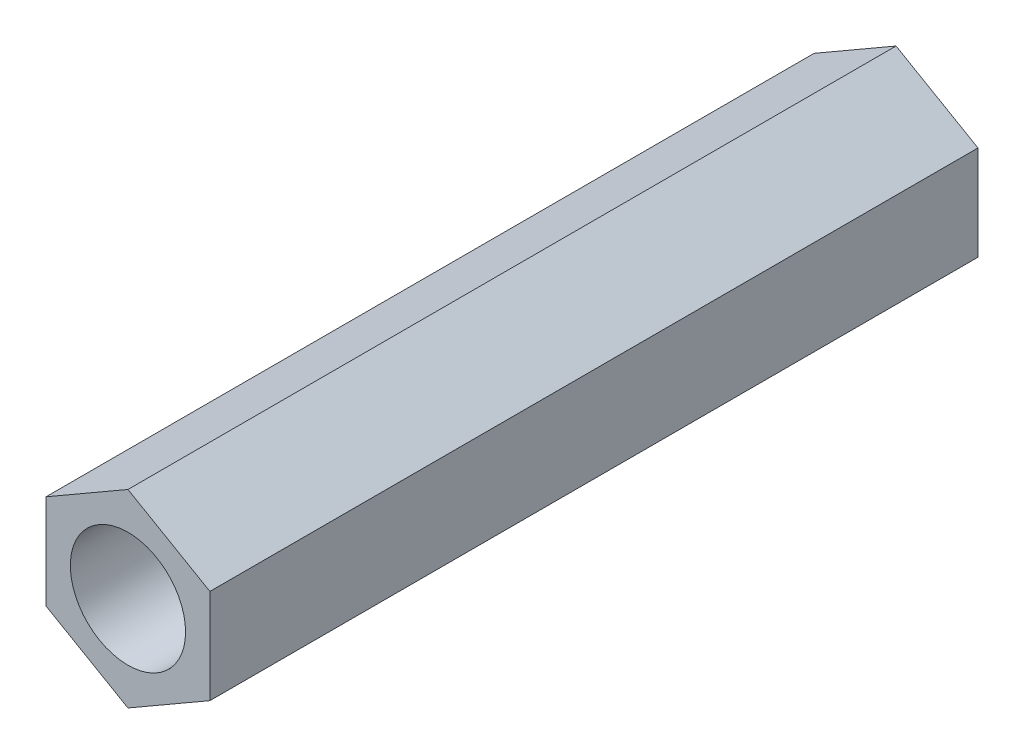
ISO-10303-21;
HEADER;
FILE_DESCRIPTION(('STEP AP214'),'2;1');
FILE_NAME('part.step','',(''),(''),'','','');
FILE_SCHEMA(('AUTOMOTIVE_DESIGN { 1 0 10303 214 1 1 1 1 }'));
ENDSEC;
DATA;
#1=APPLICATION_CONTEXT('core data for automotive mechanical design processes');
#2=APPLICATION_PROTOCOL_DEFINITION('international standard','automotive_design',2000,#1);
#3=PRODUCT_CONTEXT('',#1,'mechanical');
#4=PRODUCT('Part','Part','',(#3));
#5=PRODUCT_RELATED_PRODUCT_CATEGORY('part','',(#4));
#6=PRODUCT_DEFINITION_FORMATION('','',#4);
#7=PRODUCT_DEFINITION_CONTEXT('part definition',#1,'design');
#8=PRODUCT_DEFINITION('design','',#6,#7);
#9=PRODUCT_DEFINITION_SHAPE('','',#8);
#10=(LENGTH_UNIT() NAMED_UNIT(*) SI_UNIT(.MILLI.,.METRE.));
#11=(NAMED_UNIT(*) PLANE_ANGLE_UNIT() SI_UNIT($,.RADIAN.));
#12=(NAMED_UNIT(*) SI_UNIT($,.STERADIAN.) SOLID_ANGLE_UNIT());
#13=UNCERTAINTY_MEASURE_WITH_UNIT(LENGTH_MEASURE(1.E-05),#10,'distance_accuracy_value','');
#14=(GEOMETRIC_REPRESENTATION_CONTEXT(3) GLOBAL_UNCERTAINTY_ASSIGNED_CONTEXT((#13)) GLOBAL_UNIT_ASSIGNED_CONTEXT((#10,
#11,#12)) REPRESENTATION_CONTEXT('',''));
#15=CARTESIAN_POINT('',(0.,0.,0.));
#16=DIRECTION('',(0.,0.,1.));
#17=DIRECTION('',(1.,0.,0.));
#18=AXIS2_PLACEMENT_3D('',#15,#16,#17);
#19=CARTESIAN_POINT('',(0.,0.,20.));
#20=DIRECTION('',(0.,0.,1.));
#21=DIRECTION('',(1.,0.,0.));
#22=AXIS2_PLACEMENT_3D('',#19,#20,#21);
#23=PLANE('',#22);
#24=DIRECTION('',(-0.866025403784442,0.499999999999995,0.));
#25=VECTOR('',#24,1.);
#26=CARTESIAN_POINT('',(2.13382530169226,1.23196461233569,20.));
#27=LINE('',#26,#25);
#28=CARTESIAN_POINT('',(2.13382530169226,1.23196461233569,20.));
#29=VERTEX_POINT('',#28);
#30=CARTESIAN_POINT('',(0.,2.46392922467133,20.));
#31=VERTEX_POINT('',#30);
#32=EDGE_CURVE('E144',#29,#31,#27,.T.);
#33=ORIENTED_EDGE('',*,*,#32,.T.);
#34=DIRECTION('',(-0.866025403784438,-0.500000000000001,0.));
#35=VECTOR('',#34,1.);
#36=CARTESIAN_POINT('',(0.,2.46392922467133,20.));
#37=LINE('',#36,#35);
#38=CARTESIAN_POINT('',(-2.13382530169227,1.23196461233566,20.));
#39=VERTEX_POINT('',#38);
#40=EDGE_CURVE('E102',#31,#39,#37,.T.);
#41=ORIENTED_EDGE('',*,*,#40,.T.);
#42=DIRECTION('',(0.,-1.,0.));
#43=VECTOR('',#42,1.);
#44=CARTESIAN_POINT('',(-2.13382530169227,1.23196461233566,20.));
#45=LINE('',#44,#43);
#46=CARTESIAN_POINT('',(-2.13382530169226,-1.23196461233568,20.));
#47=VERTEX_POINT('',#46);
#48=EDGE_CURVE('E115',#39,#47,#45,.T.);
#49=ORIENTED_EDGE('',*,*,#48,.T.);
#50=DIRECTION('',(0.866025403784442,-0.499999999999995,0.));
#51=VECTOR('',#50,1.);
#52=CARTESIAN_POINT('',(-2.13382530169226,-1.23196461233568,20.));
#53=LINE('',#52,#51);
#54=CARTESIAN_POINT('',(0.,-2.46392922467133,20.));
#55=VERTEX_POINT('',#54);
#56=EDGE_CURVE('E109',#47,#55,#53,.T.);
#57=ORIENTED_EDGE('',*,*,#56,.T.);
#58=DIRECTION('',(0.866025403784434,0.500000000000007,0.));
#59=VECTOR('',#58,1.);
#60=CARTESIAN_POINT('',(0.,-2.46392922467133,20.));
#61=LINE('',#60,#59);
#62=CARTESIAN_POINT('',(2.13382530169228,-1.23196461233565,20.));
#63=VERTEX_POINT('',#62);
#64=EDGE_CURVE('E113',#55,#63,#61,.T.);
#65=ORIENTED_EDGE('',*,*,#64,.T.);
#66=DIRECTION('',(0.,1.,0.));
#67=VECTOR('',#66,1.);
#68=CARTESIAN_POINT('',(2.13382530169228,-1.23196461233565,20.));
#69=LINE('',#68,#67);
#70=EDGE_CURVE('E65',#63,#29,#69,.T.);
#71=ORIENTED_EDGE('',*,*,#70,.T.);
#72=EDGE_LOOP('',(#33,#41,#49,#57,#65,#71));
#73=FACE_BOUND('',#72,.T.);
#74=CARTESIAN_POINT('',(0.,0.,20.));
#75=DIRECTION('',(0.,0.,1.));
#76=DIRECTION('',(1.,0.,0.));
#77=AXIS2_PLACEMENT_3D('',#74,#75,#76);
#78=CIRCLE('',#77,1.5);
#79=CARTESIAN_POINT('',(1.5,0.,20.));
#80=VERTEX_POINT('',#79);
#81=EDGE_CURVE('E137',#80,#80,#78,.T.);
#82=ORIENTED_EDGE('',*,*,#81,.F.);
#83=EDGE_LOOP('',(#82));
#84=FACE_BOUND('',#83,.T.);
#85=ADVANCED_FACE('F48',(#73,#84),#23,.T.);
#86=CARTESIAN_POINT('',(0.,0.,0.));
#87=DIRECTION('',(0.,0.,1.));
#88=DIRECTION('',(1.,0.,0.));
#89=AXIS2_PLACEMENT_3D('',#86,#87,#88);
#90=PLANE('',#89);
#91=DIRECTION('',(-0.866025403784442,0.499999999999995,0.));
#92=VECTOR('',#91,1.);
#93=CARTESIAN_POINT('',(2.13382530169226,1.23196461233569,0.));
#94=LINE('',#93,#92);
#95=CARTESIAN_POINT('',(2.13382530169226,1.23196461233569,0.));
#96=VERTEX_POINT('',#95);
#97=CARTESIAN_POINT('',(0.,2.46392922467133,0.));
#98=VERTEX_POINT('',#97);
#99=EDGE_CURVE('E133',#96,#98,#94,.T.);
#100=ORIENTED_EDGE('',*,*,#99,.F.);
#101=DIRECTION('',(0.,1.,0.));
#102=VECTOR('',#101,1.);
#103=CARTESIAN_POINT('',(2.13382530169228,-1.23196461233565,0.));
#104=LINE('',#103,#102);
#105=CARTESIAN_POINT('',(2.13382530169228,-1.23196461233565,0.));
#106=VERTEX_POINT('',#105);
#107=EDGE_CURVE('E94',#106,#96,#104,.T.);
#108=ORIENTED_EDGE('',*,*,#107,.F.);
#109=DIRECTION('',(0.866025403784434,0.500000000000007,0.));
#110=VECTOR('',#109,1.);
#111=CARTESIAN_POINT('',(0.,-2.46392922467133,0.));
#112=LINE('',#111,#110);
#113=CARTESIAN_POINT('',(0.,-2.46392922467133,0.));
#114=VERTEX_POINT('',#113);
#115=EDGE_CURVE('E88',#114,#106,#112,.T.);
#116=ORIENTED_EDGE('',*,*,#115,.F.);
#117=DIRECTION('',(0.866025403784442,-0.499999999999995,0.));
#118=VECTOR('',#117,1.);
#119=CARTESIAN_POINT('',(-2.13382530169226,-1.23196461233568,0.));
#120=LINE('',#119,#118);
#121=CARTESIAN_POINT('',(-2.13382530169226,-1.23196461233568,0.));
#122=VERTEX_POINT('',#121);
#123=EDGE_CURVE('E123',#122,#114,#120,.T.);
#124=ORIENTED_EDGE('',*,*,#123,.F.);
#125=DIRECTION('',(0.,-1.,0.));
#126=VECTOR('',#125,1.);
#127=CARTESIAN_POINT('',(-2.13382530169227,1.23196461233566,0.));
#128=LINE('',#127,#126);
#129=CARTESIAN_POINT('',(-2.13382530169227,1.23196461233566,0.));
#130=VERTEX_POINT('',#129);
#131=EDGE_CURVE('E139',#130,#122,#128,.T.);
#132=ORIENTED_EDGE('',*,*,#131,.F.);
#133=DIRECTION('',(-0.866025403784438,-0.500000000000001,0.));
#134=VECTOR('',#133,1.);
#135=CARTESIAN_POINT('',(0.,2.46392922467133,0.));
#136=LINE('',#135,#134);
#137=EDGE_CURVE('E136',#98,#130,#136,.T.);
#138=ORIENTED_EDGE('',*,*,#137,.F.);
#139=EDGE_LOOP('',(#100,#108,#116,#124,#132,#138));
#140=FACE_BOUND('',#139,.T.);
#141=CARTESIAN_POINT('',(0.,0.,0.));
#142=DIRECTION('',(0.,0.,1.));
#143=DIRECTION('',(1.,0.,0.));
#144=AXIS2_PLACEMENT_3D('',#141,#142,#143);
#145=CIRCLE('',#144,1.5);
#146=CARTESIAN_POINT('',(1.5,0.,0.));
#147=VERTEX_POINT('',#146);
#148=EDGE_CURVE('E237',#147,#147,#145,.T.);
#149=ORIENTED_EDGE('',*,*,#148,.T.);
#150=EDGE_LOOP('',(#149));
#151=FACE_BOUND('',#150,.T.);
#152=ADVANCED_FACE('F153',(#140,#151),#90,.F.);
#153=CARTESIAN_POINT('',(2.13382530169226,1.23196461233569,20.));
#154=DIRECTION('',(-0.499999999999995,-0.866025403784442,0.));
#155=DIRECTION('',(0.866025403784442,-0.499999999999995,0.));
#156=AXIS2_PLACEMENT_3D('',#153,#154,#155);
#157=PLANE('',#156);
#158=ORIENTED_EDGE('',*,*,#99,.T.);
#159=DIRECTION('',(0.,0.,-1.));
#160=VECTOR('',#159,1.);
#161=CARTESIAN_POINT('',(0.,2.46392922467133,20.));
#162=LINE('',#161,#160);
#163=EDGE_CURVE('E13',#31,#98,#162,.T.);
#164=ORIENTED_EDGE('',*,*,#163,.F.);
#165=ORIENTED_EDGE('',*,*,#32,.F.);
#166=DIRECTION('',(0.,0.,-1.));
#167=VECTOR('',#166,1.);
#168=CARTESIAN_POINT('',(2.13382530169226,1.23196461233569,20.));
#169=LINE('',#168,#167);
#170=EDGE_CURVE('E129',#29,#96,#169,.T.);
#171=ORIENTED_EDGE('',*,*,#170,.T.);
#172=EDGE_LOOP('',(#158,#164,#165,#171));
#173=FACE_BOUND('',#172,.T.);
#174=ADVANCED_FACE('F50',(#173),#157,.F.);
#175=CARTESIAN_POINT('',(0.,2.46392922467133,20.));
#176=DIRECTION('',(0.500000000000001,-0.866025403784438,0.));
#177=DIRECTION('',(0.866025403784438,0.500000000000001,0.));
#178=AXIS2_PLACEMENT_3D('',#175,#176,#177);
#179=PLANE('',#178);
#180=ORIENTED_EDGE('',*,*,#137,.T.);
#181=DIRECTION('',(0.,0.,-1.));
#182=VECTOR('',#181,1.);
#183=CARTESIAN_POINT('',(-2.13382530169227,1.23196461233566,20.));
#184=LINE('',#183,#182);
#185=EDGE_CURVE('E57',#39,#130,#184,.T.);
#186=ORIENTED_EDGE('',*,*,#185,.F.);
#187=ORIENTED_EDGE('',*,*,#40,.F.);
#188=ORIENTED_EDGE('',*,*,#163,.T.);
#189=EDGE_LOOP('',(#180,#186,#187,#188));
#190=FACE_BOUND('',#189,.T.);
#191=ADVANCED_FACE('F178',(#190),#179,.F.);
#192=CARTESIAN_POINT('',(-2.13382530169227,1.23196461233566,20.));
#193=DIRECTION('',(1.,0.,0.));
#194=DIRECTION('',(0.,1.,0.));
#195=AXIS2_PLACEMENT_3D('',#192,#193,#194);
#196=PLANE('',#195);
#197=ORIENTED_EDGE('',*,*,#131,.T.);
#198=DIRECTION('',(0.,0.,-1.));
#199=VECTOR('',#198,1.);
#200=CARTESIAN_POINT('',(-2.13382530169226,-1.23196461233568,20.));
#201=LINE('',#200,#199);
#202=EDGE_CURVE('E124',#47,#122,#201,.T.);
#203=ORIENTED_EDGE('',*,*,#202,.F.);
#204=ORIENTED_EDGE('',*,*,#48,.F.);
#205=ORIENTED_EDGE('',*,*,#185,.T.);
#206=EDGE_LOOP('',(#197,#203,#204,#205));
#207=FACE_BOUND('',#206,.T.);
#208=ADVANCED_FACE('F150',(#207),#196,.F.);
#209=CARTESIAN_POINT('',(-2.13382530169226,-1.23196461233568,20.));
#210=DIRECTION('',(0.499999999999995,0.866025403784442,0.));
#211=DIRECTION('',(-0.866025403784442,0.499999999999995,0.));
#212=AXIS2_PLACEMENT_3D('',#209,#210,#211);
#213=PLANE('',#212);
#214=ORIENTED_EDGE('',*,*,#123,.T.);
#215=DIRECTION('',(0.,0.,-1.));
#216=VECTOR('',#215,1.);
#217=CARTESIAN_POINT('',(0.,-2.46392922467133,20.));
#218=LINE('',#217,#216);
#219=EDGE_CURVE('E120',#55,#114,#218,.T.);
#220=ORIENTED_EDGE('',*,*,#219,.F.);
#221=ORIENTED_EDGE('',*,*,#56,.F.);
#222=ORIENTED_EDGE('',*,*,#202,.T.);
#223=EDGE_LOOP('',(#214,#220,#221,#222));
#224=FACE_BOUND('',#223,.T.);
#225=ADVANCED_FACE('F121',(#224),#213,.F.);
#226=CARTESIAN_POINT('',(0.,-2.46392922467133,20.));
#227=DIRECTION('',(-0.500000000000007,0.866025403784435,0.));
#228=DIRECTION('',(-0.866025403784435,-0.500000000000007,0.));
#229=AXIS2_PLACEMENT_3D('',#226,#227,#228);
#230=PLANE('',#229);
#231=ORIENTED_EDGE('',*,*,#115,.T.);
#232=DIRECTION('',(0.,0.,-1.));
#233=VECTOR('',#232,1.);
#234=CARTESIAN_POINT('',(2.13382530169228,-1.23196461233565,20.));
#235=LINE('',#234,#233);
#236=EDGE_CURVE('E125',#63,#106,#235,.T.);
#237=ORIENTED_EDGE('',*,*,#236,.F.);
#238=ORIENTED_EDGE('',*,*,#64,.F.);
#239=ORIENTED_EDGE('',*,*,#219,.T.);
#240=EDGE_LOOP('',(#231,#237,#238,#239));
#241=FACE_BOUND('',#240,.T.);
#242=ADVANCED_FACE('F127',(#241),#230,.F.);
#243=CARTESIAN_POINT('',(2.13382530169228,-1.23196461233565,20.));
#244=DIRECTION('',(-1.,0.,0.));
#245=DIRECTION('',(0.,-1.,0.));
#246=AXIS2_PLACEMENT_3D('',#243,#244,#245);
#247=PLANE('',#246);
#248=ORIENTED_EDGE('',*,*,#107,.T.);
#249=ORIENTED_EDGE('',*,*,#170,.F.);
#250=ORIENTED_EDGE('',*,*,#70,.F.);
#251=ORIENTED_EDGE('',*,*,#236,.T.);
#252=EDGE_LOOP('',(#248,#249,#250,#251));
#253=FACE_BOUND('',#252,.T.);
#254=ADVANCED_FACE('F158',(#253),#247,.F.);
#255=CARTESIAN_POINT('',(0.,0.,20.));
#256=DIRECTION('',(0.,0.,-1.));
#257=DIRECTION('',(-1.,0.,0.));
#258=AXIS2_PLACEMENT_3D('',#255,#256,#257);
#259=CYLINDRICAL_SURFACE('',#258,1.5);
#260=ORIENTED_EDGE('',*,*,#81,.T.);
#261=EDGE_LOOP('',(#260));
#262=FACE_BOUND('',#261,.T.);
#263=ORIENTED_EDGE('',*,*,#148,.F.);
#264=EDGE_LOOP('',(#263));
#265=FACE_BOUND('',#264,.T.);
#266=ADVANCED_FACE('F160',(#262,#265),#259,.F.);
#267=CLOSED_SHELL('',(#85,#152,#174,#191,#208,#225,#242,#254,#266));
#268=MANIFOLD_SOLID_BREP('B2',#267);
#269=ADVANCED_BREP_SHAPE_REPRESENTATION('',(#18,#268),#14);
#270=SHAPE_DEFINITION_REPRESENTATION(#9,#269);
ENDSEC;
END-ISO-10303-21;
